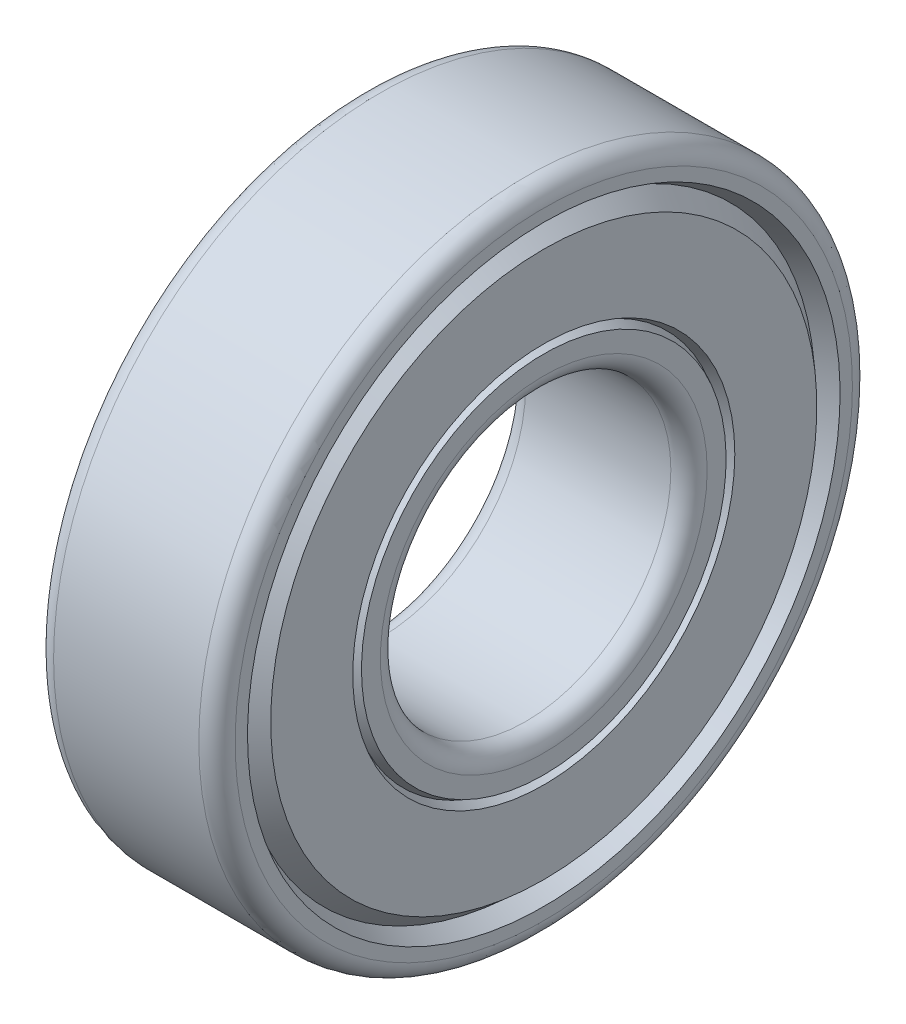
ISO-10303-21;
HEADER;
FILE_DESCRIPTION(('STEP AP214'),'2;1');
FILE_NAME('part.step','',(''),(''),'','','');
FILE_SCHEMA(('AUTOMOTIVE_DESIGN { 1 0 10303 214 1 1 1 1 }'));
ENDSEC;
DATA;
#1=APPLICATION_CONTEXT('core data for automotive mechanical design processes');
#2=APPLICATION_PROTOCOL_DEFINITION('international standard','automotive_design',2000,#1);
#3=PRODUCT_CONTEXT('',#1,'mechanical');
#4=PRODUCT('Part','Part','',(#3));
#5=PRODUCT_RELATED_PRODUCT_CATEGORY('part','',(#4));
#6=PRODUCT_DEFINITION_FORMATION('','',#4);
#7=PRODUCT_DEFINITION_CONTEXT('part definition',#1,'design');
#8=PRODUCT_DEFINITION('design','',#6,#7);
#9=PRODUCT_DEFINITION_SHAPE('','',#8);
#10=(LENGTH_UNIT() NAMED_UNIT(*) SI_UNIT(.MILLI.,.METRE.));
#11=(NAMED_UNIT(*) PLANE_ANGLE_UNIT() SI_UNIT($,.RADIAN.));
#12=(NAMED_UNIT(*) SI_UNIT($,.STERADIAN.) SOLID_ANGLE_UNIT());
#13=UNCERTAINTY_MEASURE_WITH_UNIT(LENGTH_MEASURE(1.E-05),#10,'distance_accuracy_value','');
#14=(GEOMETRIC_REPRESENTATION_CONTEXT(3) GLOBAL_UNCERTAINTY_ASSIGNED_CONTEXT((#13)) GLOBAL_UNIT_ASSIGNED_CONTEXT((#10,
#11,#12)) REPRESENTATION_CONTEXT('',''));
#15=CARTESIAN_POINT('',(0.,0.,0.));
#16=DIRECTION('',(0.,0.,1.));
#17=DIRECTION('',(1.,0.,0.));
#18=AXIS2_PLACEMENT_3D('',#15,#16,#17);
#19=CARTESIAN_POINT('',(-59.8380430228276,20.5988206252527,15.0345706132385));
#20=DIRECTION('',(-1.,0.,0.));
#21=DIRECTION('',(0.,0.,1.));
#22=AXIS2_PLACEMENT_3D('',#19,#20,#21);
#23=CYLINDRICAL_SURFACE('',#22,6.35);
#24=CARTESIAN_POINT('',(-59.0442930225736,20.5988206252527,15.0345706132385));
#25=DIRECTION('',(1.,0.,0.));
#26=DIRECTION('',(0.,0.,-1.));
#27=AXIS2_PLACEMENT_3D('',#24,#25,#26);
#28=CIRCLE('',#27,6.35);
#29=CARTESIAN_POINT('',(-59.0442930225736,20.5988206252527,8.6845706132385));
#30=VERTEX_POINT('',#29);
#31=EDGE_CURVE('E179',#30,#30,#28,.T.);
#32=ORIENTED_EDGE('',*,*,#31,.F.);
#33=EDGE_LOOP('',(#32));
#34=FACE_BOUND('',#33,.T.);
#35=CARTESIAN_POINT('',(-52.6942930225736,20.5988206252527,15.0345706132385));
#36=DIRECTION('',(1.,0.,0.));
#37=DIRECTION('',(0.,0.,-1.));
#38=AXIS2_PLACEMENT_3D('',#35,#36,#37);
#39=CIRCLE('',#38,6.35);
#40=CARTESIAN_POINT('',(-52.6942930225736,20.5988206252527,8.6845706132385));
#41=VERTEX_POINT('',#40);
#42=EDGE_CURVE('E158',#41,#41,#39,.F.);
#43=ORIENTED_EDGE('',*,*,#42,.F.);
#44=EDGE_LOOP('',(#43));
#45=FACE_BOUND('',#44,.T.);
#46=ADVANCED_FACE('F15',(#34,#45),#23,.F.);
#47=CARTESIAN_POINT('',(-59.0442930228276,20.5988206252527,15.0345706132385));
#48=DIRECTION('',(1.,0.,0.));
#49=DIRECTION('',(0.,0.,-1.));
#50=AXIS2_PLACEMENT_3D('',#47,#48,#49);
#51=TOROIDAL_SURFACE('',#50,7.14375,0.79375);
#52=ORIENTED_EDGE('',*,*,#31,.T.);
#53=EDGE_LOOP('',(#52));
#54=FACE_BOUND('',#53,.T.);
#55=CARTESIAN_POINT('',(-59.8380430228276,20.5988206252527,15.0345706132385));
#56=DIRECTION('',(-1.,0.,0.));
#57=DIRECTION('',(0.,0.,-1.));
#58=AXIS2_PLACEMENT_3D('',#55,#56,#57);
#59=CIRCLE('',#58,7.14375000025405);
#60=CARTESIAN_POINT('',(-59.8380430228276,20.5988206252527,7.89082061298445));
#61=VERTEX_POINT('',#60);
#62=EDGE_CURVE('E147',#61,#61,#59,.T.);
#63=ORIENTED_EDGE('',*,*,#62,.T.);
#64=EDGE_LOOP('',(#63));
#65=FACE_BOUND('',#64,.T.);
#66=ADVANCED_FACE('F163',(#54,#65),#51,.T.);
#67=CARTESIAN_POINT('',(-52.6942930228276,20.5988206252527,15.0345706132385));
#68=DIRECTION('',(1.,0.,0.));
#69=DIRECTION('',(0.,0.,-1.));
#70=AXIS2_PLACEMENT_3D('',#67,#68,#69);
#71=TOROIDAL_SURFACE('',#70,7.14375,0.79375);
#72=CARTESIAN_POINT('',(-51.9005430228276,20.5988206252527,15.0345706132385));
#73=DIRECTION('',(1.,0.,0.));
#74=DIRECTION('',(0.,0.,-1.));
#75=AXIS2_PLACEMENT_3D('',#72,#73,#74);
#76=CIRCLE('',#75,7.14375000025405);
#77=CARTESIAN_POINT('',(-51.9005430228276,20.5988206252527,7.89082061298445));
#78=VERTEX_POINT('',#77);
#79=EDGE_CURVE('E221',#78,#78,#76,.F.);
#80=ORIENTED_EDGE('',*,*,#79,.F.);
#81=EDGE_LOOP('',(#80));
#82=FACE_BOUND('',#81,.T.);
#83=ORIENTED_EDGE('',*,*,#42,.T.);
#84=EDGE_LOOP('',(#83));
#85=FACE_BOUND('',#84,.T.);
#86=ADVANCED_FACE('F160',(#82,#85),#71,.T.);
#87=CARTESIAN_POINT('',(-59.8380430228276,20.5988206252527,15.0345706132385));
#88=DIRECTION('',(1.,0.,0.));
#89=DIRECTION('',(0.,0.,-1.));
#90=AXIS2_PLACEMENT_3D('',#87,#88,#89);
#91=PLANE('',#90);
#92=ORIENTED_EDGE('',*,*,#62,.F.);
#93=EDGE_LOOP('',(#92));
#94=FACE_BOUND('',#93,.T.);
#95=CARTESIAN_POINT('',(-59.8380430192509,20.5988206252527,15.0345706132385));
#96=DIRECTION('',(1.,0.,0.));
#97=DIRECTION('',(0.,1.,0.));
#98=AXIS2_PLACEMENT_3D('',#95,#96,#97);
#99=CIRCLE('',#98,7.97135160178837);
#100=CARTESIAN_POINT('',(-59.8380430192509,28.5701722270411,15.0345706132385));
#101=VERTEX_POINT('',#100);
#102=EDGE_CURVE('E18',#101,#101,#99,.T.);
#103=ORIENTED_EDGE('',*,*,#102,.F.);
#104=EDGE_LOOP('',(#103));
#105=FACE_BOUND('',#104,.T.);
#106=ADVANCED_FACE('F127',(#94,#105),#91,.F.);
#107=CARTESIAN_POINT('',(-51.9005430228276,20.5988206252527,15.0345706132385));
#108=DIRECTION('',(1.,0.,0.));
#109=DIRECTION('',(0.,0.,-1.));
#110=AXIS2_PLACEMENT_3D('',#107,#108,#109);
#111=PLANE('',#110);
#112=ORIENTED_EDGE('',*,*,#79,.T.);
#113=EDGE_LOOP('',(#112));
#114=FACE_BOUND('',#113,.T.);
#115=CARTESIAN_POINT('',(-51.900543025998,20.5988206252527,15.0345706132385));
#116=DIRECTION('',(-1.,0.,0.));
#117=DIRECTION('',(0.,-1.,0.));
#118=AXIS2_PLACEMENT_3D('',#115,#116,#117);
#119=CIRCLE('',#118,7.97135160158518);
#120=CARTESIAN_POINT('',(-51.900543025998,12.6274690236675,15.0345706132385));
#121=VERTEX_POINT('',#120);
#122=EDGE_CURVE('E214',#121,#121,#119,.T.);
#123=ORIENTED_EDGE('',*,*,#122,.F.);
#124=EDGE_LOOP('',(#123));
#125=FACE_BOUND('',#124,.T.);
#126=ADVANCED_FACE('F122',(#114,#125),#111,.T.);
#127=CARTESIAN_POINT('',(-59.4570430192507,20.5988206252527,15.0345706132385));
#128=DIRECTION('',(1.,0.,0.));
#129=DIRECTION('',(0.,1.,0.));
#130=AXIS2_PLACEMENT_3D('',#127,#128,#129);
#131=CONICAL_SURFACE('',#130,8.16185160178807,0.463647609000001);
#132=ORIENTED_EDGE('',*,*,#102,.T.);
#133=EDGE_LOOP('',(#132));
#134=FACE_BOUND('',#133,.T.);
#135=CARTESIAN_POINT('',(-59.4570430259979,20.5988206252527,15.0345706132385));
#136=DIRECTION('',(-1.,0.,0.));
#137=DIRECTION('',(0.,0.,1.));
#138=AXIS2_PLACEMENT_3D('',#135,#136,#137);
#139=CIRCLE('',#138,8.16185160158517);
#140=CARTESIAN_POINT('',(-59.4570430259979,20.5988206252527,23.1964222148237));
#141=VERTEX_POINT('',#140);
#142=EDGE_CURVE('E216',#141,#141,#139,.T.);
#143=ORIENTED_EDGE('',*,*,#142,.T.);
#144=EDGE_LOOP('',(#143));
#145=FACE_BOUND('',#144,.T.);
#146=ADVANCED_FACE('F118',(#134,#145),#131,.T.);
#147=CARTESIAN_POINT('',(-52.2815430259981,20.5988206252527,15.0345706132385));
#148=DIRECTION('',(-1.,0.,0.));
#149=DIRECTION('',(0.,-1.,0.));
#150=AXIS2_PLACEMENT_3D('',#147,#148,#149);
#151=CONICAL_SURFACE('',#150,8.16185160158487,0.463647609000001);
#152=ORIENTED_EDGE('',*,*,#122,.T.);
#153=EDGE_LOOP('',(#152));
#154=FACE_BOUND('',#153,.T.);
#155=CARTESIAN_POINT('',(-52.2815430192509,20.5988206252527,15.0345706132385));
#156=DIRECTION('',(1.,0.,0.));
#157=DIRECTION('',(0.,0.,1.));
#158=AXIS2_PLACEMENT_3D('',#155,#156,#157);
#159=CIRCLE('',#158,8.16185160178837);
#160=CARTESIAN_POINT('',(-52.2815430192509,20.5988206252527,23.1964222150269));
#161=VERTEX_POINT('',#160);
#162=EDGE_CURVE('E213',#161,#161,#159,.T.);
#163=ORIENTED_EDGE('',*,*,#162,.T.);
#164=EDGE_LOOP('',(#163));
#165=FACE_BOUND('',#164,.T.);
#166=ADVANCED_FACE('F114',(#154,#165),#151,.T.);
#167=CARTESIAN_POINT('',(-59.8380430262013,20.5988206252527,15.0345706132385));
#168=DIRECTION('',(-1.,0.,0.));
#169=DIRECTION('',(0.,0.,1.));
#170=AXIS2_PLACEMENT_3D('',#167,#168,#169);
#171=CONICAL_SURFACE('',#170,8.35235160168647,0.463647608999997);
#172=ORIENTED_EDGE('',*,*,#142,.F.);
#173=EDGE_LOOP('',(#172));
#174=FACE_BOUND('',#173,.T.);
#175=CARTESIAN_POINT('',(-59.8380430262013,20.5988206252527,15.0345706132385));
#176=DIRECTION('',(-1.,0.,0.));
#177=DIRECTION('',(0.,0.,1.));
#178=AXIS2_PLACEMENT_3D('',#175,#176,#177);
#179=CIRCLE('',#178,8.35235160168647);
#180=CARTESIAN_POINT('',(-59.8380430262013,20.5988206252527,23.386922214925));
#181=VERTEX_POINT('',#180);
#182=EDGE_CURVE('E211',#181,#181,#179,.T.);
#183=ORIENTED_EDGE('',*,*,#182,.T.);
#184=EDGE_LOOP('',(#183));
#185=FACE_BOUND('',#184,.T.);
#186=ADVANCED_FACE('F110',(#174,#185),#171,.F.);
#187=CARTESIAN_POINT('',(-51.9005430192507,20.5988206252527,15.0345706132385));
#188=DIRECTION('',(1.,0.,0.));
#189=DIRECTION('',(0.,0.,-1.));
#190=AXIS2_PLACEMENT_3D('',#187,#188,#189);
#191=CONICAL_SURFACE('',#190,8.35235160178807,0.463647608999997);
#192=ORIENTED_EDGE('',*,*,#162,.F.);
#193=EDGE_LOOP('',(#192));
#194=FACE_BOUND('',#193,.T.);
#195=CARTESIAN_POINT('',(-51.9005430192507,20.5988206252527,15.0345706132385));
#196=DIRECTION('',(1.,0.,0.));
#197=DIRECTION('',(0.,0.,-1.));
#198=AXIS2_PLACEMENT_3D('',#195,#196,#197);
#199=CIRCLE('',#198,8.35235160178807);
#200=CARTESIAN_POINT('',(-51.9005430192507,20.5988206252527,6.68221901145043));
#201=VERTEX_POINT('',#200);
#202=EDGE_CURVE('E208',#201,#201,#199,.F.);
#203=ORIENTED_EDGE('',*,*,#202,.F.);
#204=EDGE_LOOP('',(#203));
#205=FACE_BOUND('',#204,.T.);
#206=ADVANCED_FACE('F106',(#194,#205),#191,.F.);
#207=CARTESIAN_POINT('',(-59.8380430228276,20.5988206252527,15.0345706132385));
#208=DIRECTION('',(1.,0.,0.));
#209=DIRECTION('',(0.,0.,-1.));
#210=AXIS2_PLACEMENT_3D('',#207,#208,#209);
#211=PLANE('',#210);
#212=ORIENTED_EDGE('',*,*,#182,.F.);
#213=EDGE_LOOP('',(#212));
#214=FACE_BOUND('',#213,.T.);
#215=CARTESIAN_POINT('',(-59.838043015225,20.5988206252527,15.0345706132385));
#216=DIRECTION('',(1.,0.,0.));
#217=DIRECTION('',(0.,0.,-1.));
#218=AXIS2_PLACEMENT_3D('',#215,#216,#217);
#219=CIRCLE('',#218,11.9384999067024);
#220=CARTESIAN_POINT('',(-59.838043015225,20.5988206252527,3.0960707065361));
#221=VERTEX_POINT('',#220);
#222=EDGE_CURVE('E205',#221,#221,#219,.T.);
#223=ORIENTED_EDGE('',*,*,#222,.F.);
#224=EDGE_LOOP('',(#223));
#225=FACE_BOUND('',#224,.T.);
#226=ADVANCED_FACE('F102',(#214,#225),#211,.F.);
#227=CARTESIAN_POINT('',(-51.9005430228276,20.5988206252527,15.0345706132385));
#228=DIRECTION('',(1.,0.,0.));
#229=DIRECTION('',(0.,0.,-1.));
#230=AXIS2_PLACEMENT_3D('',#227,#228,#229);
#231=PLANE('',#230);
#232=ORIENTED_EDGE('',*,*,#202,.T.);
#233=EDGE_LOOP('',(#232));
#234=FACE_BOUND('',#233,.T.);
#235=CARTESIAN_POINT('',(-51.9005430302867,20.5988206252527,15.0345706132385));
#236=DIRECTION('',(-1.,0.,0.));
#237=DIRECTION('',(0.,-1.,0.));
#238=AXIS2_PLACEMENT_3D('',#235,#236,#237);
#239=CIRCLE('',#238,11.9384999065765);
#240=CARTESIAN_POINT('',(-51.9005430302867,8.66032071867622,15.0345706132385));
#241=VERTEX_POINT('',#240);
#242=EDGE_CURVE('E201',#241,#241,#239,.T.);
#243=ORIENTED_EDGE('',*,*,#242,.F.);
#244=EDGE_LOOP('',(#243));
#245=FACE_BOUND('',#244,.T.);
#246=ADVANCED_FACE('F98',(#234,#245),#231,.T.);
#247=CARTESIAN_POINT('',(-59.1147417496966,20.5988206252527,15.0345706132385));
#248=DIRECTION('',(1.,0.,0.));
#249=DIRECTION('',(0.,0.,-1.));
#250=AXIS2_PLACEMENT_3D('',#247,#248,#249);
#251=CONICAL_SURFACE('',#250,12.5734999068126,0.7204809086);
#252=ORIENTED_EDGE('',*,*,#222,.T.);
#253=EDGE_LOOP('',(#252));
#254=FACE_BOUND('',#253,.T.);
#255=CARTESIAN_POINT('',(-59.1147417635878,20.5988206252527,15.0345706132385));
#256=DIRECTION('',(-1.,0.,0.));
#257=DIRECTION('',(0.,0.,1.));
#258=AXIS2_PLACEMENT_3D('',#255,#256,#257);
#259=CIRCLE('',#258,12.5734999032401);
#260=CARTESIAN_POINT('',(-59.1147417635878,20.5988206252527,27.6080705164786));
#261=VERTEX_POINT('',#260);
#262=EDGE_CURVE('E204',#261,#261,#259,.T.);
#263=ORIENTED_EDGE('',*,*,#262,.T.);
#264=EDGE_LOOP('',(#263));
#265=FACE_BOUND('',#264,.T.);
#266=ADVANCED_FACE('F94',(#254,#265),#251,.T.);
#267=CARTESIAN_POINT('',(-52.6238442956717,20.5988206252527,15.0345706132385));
#268=DIRECTION('',(-1.,0.,0.));
#269=DIRECTION('',(0.,-1.,0.));
#270=AXIS2_PLACEMENT_3D('',#267,#268,#269);
#271=CONICAL_SURFACE('',#270,12.5734999065607,0.7204809086);
#272=ORIENTED_EDGE('',*,*,#242,.T.);
#273=EDGE_LOOP('',(#272));
#274=FACE_BOUND('',#273,.T.);
#275=CARTESIAN_POINT('',(-52.6238442816697,20.5988206252527,15.0345706132385));
#276=DIRECTION('',(1.,0.,0.));
#277=DIRECTION('',(0.,0.,1.));
#278=AXIS2_PLACEMENT_3D('',#275,#276,#277);
#279=CIRCLE('',#278,12.5734999034496);
#280=CARTESIAN_POINT('',(-52.6238442816697,20.5988206252527,27.6080705166881));
#281=VERTEX_POINT('',#280);
#282=EDGE_CURVE('E200',#281,#281,#279,.T.);
#283=ORIENTED_EDGE('',*,*,#282,.T.);
#284=EDGE_LOOP('',(#283));
#285=FACE_BOUND('',#284,.T.);
#286=ADVANCED_FACE('F90',(#274,#285),#271,.T.);
#287=CARTESIAN_POINT('',(-59.8380430291621,20.5988206252527,15.0345706132385));
#288=DIRECTION('',(-1.,0.,0.));
#289=DIRECTION('',(0.,0.,1.));
#290=AXIS2_PLACEMENT_3D('',#287,#288,#289);
#291=CONICAL_SURFACE('',#290,12.9544999033367,0.484819035399998);
#292=ORIENTED_EDGE('',*,*,#262,.F.);
#293=EDGE_LOOP('',(#292));
#294=FACE_BOUND('',#293,.T.);
#295=CARTESIAN_POINT('',(-59.8380430291621,20.5988206252527,15.0345706132385));
#296=DIRECTION('',(-1.,0.,0.));
#297=DIRECTION('',(0.,0.,1.));
#298=AXIS2_PLACEMENT_3D('',#295,#296,#297);
#299=CIRCLE('',#298,12.9544999033367);
#300=CARTESIAN_POINT('',(-59.8380430291621,20.5988206252527,27.9890705165752));
#301=VERTEX_POINT('',#300);
#302=EDGE_CURVE('E197',#301,#301,#299,.T.);
#303=ORIENTED_EDGE('',*,*,#302,.T.);
#304=EDGE_LOOP('',(#303));
#305=FACE_BOUND('',#304,.T.);
#306=ADVANCED_FACE('F86',(#294,#305),#291,.F.);
#307=CARTESIAN_POINT('',(-51.9005430162943,20.5988206252527,15.0345706132385));
#308=DIRECTION('',(1.,0.,0.));
#309=DIRECTION('',(0.,1.,0.));
#310=AXIS2_PLACEMENT_3D('',#307,#308,#309);
#311=CONICAL_SURFACE('',#310,12.9544999034414,0.484819035400002);
#312=ORIENTED_EDGE('',*,*,#282,.F.);
#313=EDGE_LOOP('',(#312));
#314=FACE_BOUND('',#313,.T.);
#315=CARTESIAN_POINT('',(-51.9005430162943,20.5988206252527,15.0345706132385));
#316=DIRECTION('',(1.,0.,0.));
#317=DIRECTION('',(0.,1.,0.));
#318=AXIS2_PLACEMENT_3D('',#315,#316,#317);
#319=CIRCLE('',#318,12.9544999034414);
#320=CARTESIAN_POINT('',(-51.9005430162943,33.5533205286941,15.0345706132385));
#321=VERTEX_POINT('',#320);
#322=EDGE_CURVE('E189',#321,#321,#319,.F.);
#323=ORIENTED_EDGE('',*,*,#322,.F.);
#324=EDGE_LOOP('',(#323));
#325=FACE_BOUND('',#324,.T.);
#326=ADVANCED_FACE('F81',(#314,#325),#311,.F.);
#327=CARTESIAN_POINT('',(-59.8380430228276,20.5988206252527,15.0345706132385));
#328=DIRECTION('',(1.,0.,0.));
#329=DIRECTION('',(0.,0.,-1.));
#330=AXIS2_PLACEMENT_3D('',#327,#328,#329);
#331=PLANE('',#330);
#332=ORIENTED_EDGE('',*,*,#302,.F.);
#333=EDGE_LOOP('',(#332));
#334=FACE_BOUND('',#333,.T.);
#335=CARTESIAN_POINT('',(-59.8380430228276,20.5988206252527,15.0345706132385));
#336=DIRECTION('',(1.,0.,0.));
#337=DIRECTION('',(0.,0.,-1.));
#338=AXIS2_PLACEMENT_3D('',#335,#336,#337);
#339=CIRCLE('',#338,13.4937500002541);
#340=CARTESIAN_POINT('',(-59.8380430228276,20.5988206252527,1.54082061298445));
#341=VERTEX_POINT('',#340);
#342=EDGE_CURVE('E65',#341,#341,#339,.T.);
#343=ORIENTED_EDGE('',*,*,#342,.F.);
#344=EDGE_LOOP('',(#343));
#345=FACE_BOUND('',#344,.T.);
#346=ADVANCED_FACE('F71',(#334,#345),#331,.F.);
#347=CARTESIAN_POINT('',(-51.9005430228276,20.5988206252527,15.0345706132385));
#348=DIRECTION('',(1.,0.,0.));
#349=DIRECTION('',(0.,0.,-1.));
#350=AXIS2_PLACEMENT_3D('',#347,#348,#349);
#351=PLANE('',#350);
#352=ORIENTED_EDGE('',*,*,#322,.T.);
#353=EDGE_LOOP('',(#352));
#354=FACE_BOUND('',#353,.T.);
#355=CARTESIAN_POINT('',(-51.9005430228276,20.5988206252527,15.0345706132385));
#356=DIRECTION('',(-1.,0.,0.));
#357=DIRECTION('',(0.,0.,-1.));
#358=AXIS2_PLACEMENT_3D('',#355,#356,#357);
#359=CIRCLE('',#358,13.4937500002541);
#360=CARTESIAN_POINT('',(-51.9005430228276,20.5988206252527,1.54082061298445));
#361=VERTEX_POINT('',#360);
#362=EDGE_CURVE('E27',#361,#361,#359,.T.);
#363=ORIENTED_EDGE('',*,*,#362,.F.);
#364=EDGE_LOOP('',(#363));
#365=FACE_BOUND('',#364,.T.);
#366=ADVANCED_FACE('F80',(#354,#365),#351,.T.);
#367=CARTESIAN_POINT('',(-59.0442930228276,20.5988206252527,15.0345706132385));
#368=DIRECTION('',(1.,0.,0.));
#369=DIRECTION('',(0.,0.,-1.));
#370=AXIS2_PLACEMENT_3D('',#367,#368,#369);
#371=TOROIDAL_SURFACE('',#370,13.49375,0.79375);
#372=ORIENTED_EDGE('',*,*,#342,.T.);
#373=EDGE_LOOP('',(#372));
#374=FACE_BOUND('',#373,.T.);
#375=CARTESIAN_POINT('',(-59.0442930225736,20.5988206252527,15.0345706132385));
#376=DIRECTION('',(1.,0.,0.));
#377=DIRECTION('',(0.,0.,-1.));
#378=AXIS2_PLACEMENT_3D('',#375,#376,#377);
#379=CIRCLE('',#378,14.2875);
#380=CARTESIAN_POINT('',(-59.0442930225736,20.5988206252527,0.747070613238501));
#381=VERTEX_POINT('',#380);
#382=EDGE_CURVE('E22',#381,#381,#379,.T.);
#383=ORIENTED_EDGE('',*,*,#382,.F.);
#384=EDGE_LOOP('',(#383));
#385=FACE_BOUND('',#384,.T.);
#386=ADVANCED_FACE('F45',(#374,#385),#371,.T.);
#387=CARTESIAN_POINT('',(-52.6942930228276,20.5988206252527,15.0345706132385));
#388=DIRECTION('',(1.,0.,0.));
#389=DIRECTION('',(0.,0.,-1.));
#390=AXIS2_PLACEMENT_3D('',#387,#388,#389);
#391=TOROIDAL_SURFACE('',#390,13.49375,0.79375);
#392=CARTESIAN_POINT('',(-52.6942930225736,20.5988206252527,15.0345706132385));
#393=DIRECTION('',(1.,0.,0.));
#394=DIRECTION('',(0.,0.,-1.));
#395=AXIS2_PLACEMENT_3D('',#392,#393,#394);
#396=CIRCLE('',#395,14.2875);
#397=CARTESIAN_POINT('',(-52.6942930225736,20.5988206252527,0.747070613238501));
#398=VERTEX_POINT('',#397);
#399=EDGE_CURVE('E10',#398,#398,#396,.F.);
#400=ORIENTED_EDGE('',*,*,#399,.F.);
#401=EDGE_LOOP('',(#400));
#402=FACE_BOUND('',#401,.T.);
#403=ORIENTED_EDGE('',*,*,#362,.T.);
#404=EDGE_LOOP('',(#403));
#405=FACE_BOUND('',#404,.T.);
#406=ADVANCED_FACE('F39',(#402,#405),#391,.T.);
#407=CARTESIAN_POINT('',(-51.9005430228276,20.5988206252527,15.0345706132385));
#408=DIRECTION('',(1.,0.,0.));
#409=DIRECTION('',(0.,0.,-1.));
#410=AXIS2_PLACEMENT_3D('',#407,#408,#409);
#411=CYLINDRICAL_SURFACE('',#410,14.2875);
#412=ORIENTED_EDGE('',*,*,#399,.T.);
#413=EDGE_LOOP('',(#412));
#414=FACE_BOUND('',#413,.T.);
#415=ORIENTED_EDGE('',*,*,#382,.T.);
#416=EDGE_LOOP('',(#415));
#417=FACE_BOUND('',#416,.T.);
#418=ADVANCED_FACE('F44',(#414,#417),#411,.T.);
#419=CLOSED_SHELL('',(#46,#66,#86,#106,#126,#146,#166,#186,#206,#226,#246,#266,#286,#306,#326,
#346,#366,#386,#406,#418));
#420=MANIFOLD_SOLID_BREP('B1',#419);
#421=ADVANCED_BREP_SHAPE_REPRESENTATION('',(#18,#420),#14);
#422=SHAPE_DEFINITION_REPRESENTATION(#9,#421);
ENDSEC;
END-ISO-10303-21;
